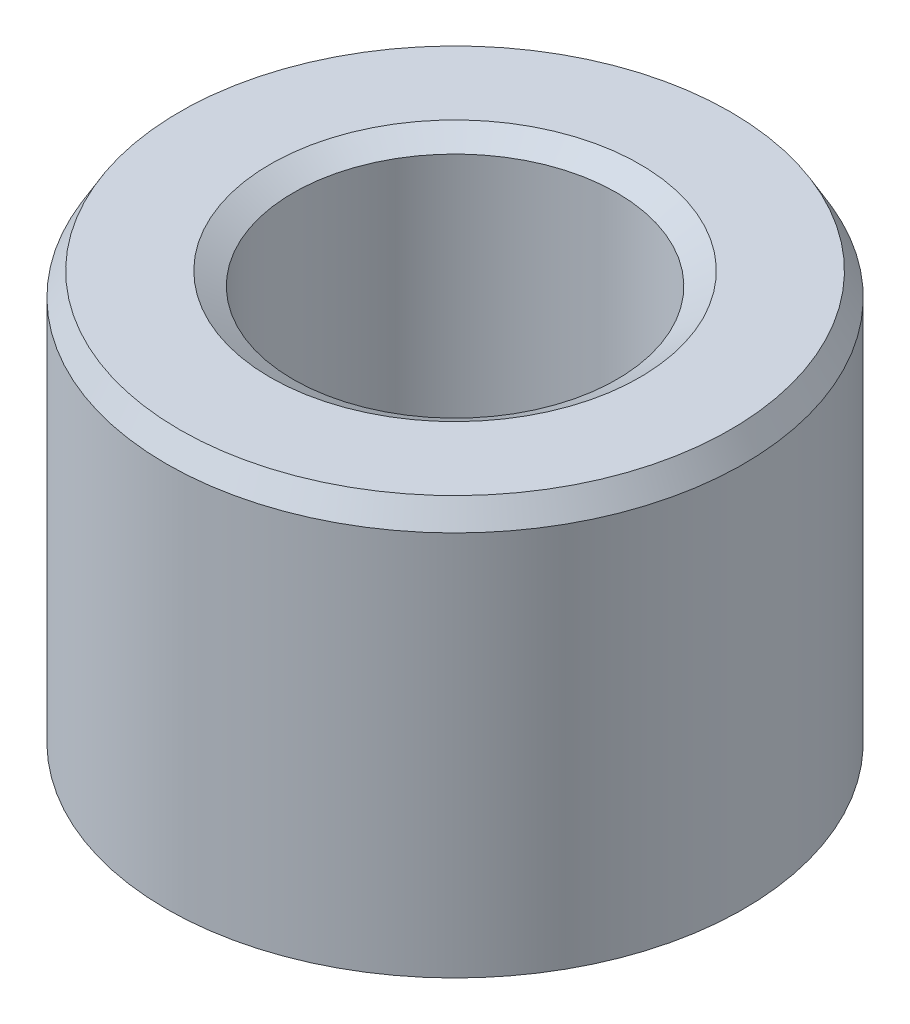
ISO-10303-21;
HEADER;
FILE_DESCRIPTION(('STEP AP214'),'2;1');
FILE_NAME('part.step','',(''),(''),'','','');
FILE_SCHEMA(('AUTOMOTIVE_DESIGN { 1 0 10303 214 1 1 1 1 }'));
ENDSEC;
DATA;
#1=APPLICATION_CONTEXT('core data for automotive mechanical design processes');
#2=APPLICATION_PROTOCOL_DEFINITION('international standard','automotive_design',2000,#1);
#3=PRODUCT_CONTEXT('',#1,'mechanical');
#4=PRODUCT('Part','Part','',(#3));
#5=PRODUCT_RELATED_PRODUCT_CATEGORY('part','',(#4));
#6=PRODUCT_DEFINITION_FORMATION('','',#4);
#7=PRODUCT_DEFINITION_CONTEXT('part definition',#1,'design');
#8=PRODUCT_DEFINITION('design','',#6,#7);
#9=PRODUCT_DEFINITION_SHAPE('','',#8);
#10=(LENGTH_UNIT() NAMED_UNIT(*) SI_UNIT(.MILLI.,.METRE.));
#11=(NAMED_UNIT(*) PLANE_ANGLE_UNIT() SI_UNIT($,.RADIAN.));
#12=(NAMED_UNIT(*) SI_UNIT($,.STERADIAN.) SOLID_ANGLE_UNIT());
#13=UNCERTAINTY_MEASURE_WITH_UNIT(LENGTH_MEASURE(1.E-05),#10,'distance_accuracy_value','');
#14=(GEOMETRIC_REPRESENTATION_CONTEXT(3) GLOBAL_UNCERTAINTY_ASSIGNED_CONTEXT((#13)) GLOBAL_UNIT_ASSIGNED_CONTEXT((#10,
#11,#12)) REPRESENTATION_CONTEXT('',''));
#15=CARTESIAN_POINT('',(0.,0.,0.));
#16=DIRECTION('',(0.,0.,1.));
#17=DIRECTION('',(1.,0.,0.));
#18=AXIS2_PLACEMENT_3D('',#15,#16,#17);
#19=CARTESIAN_POINT('',(0.,32.8723258040792,0.));
#20=DIRECTION('',(0.,-1.,0.));
#21=DIRECTION('',(0.,0.,-1.));
#22=AXIS2_PLACEMENT_3D('',#19,#20,#21);
#23=CYLINDRICAL_SURFACE('',#22,22.5);
#24=CARTESIAN_POINT('',(0.,1.03474750915446,0.));
#25=DIRECTION('',(0.,1.,0.));
#26=DIRECTION('',(0.,0.,1.));
#27=AXIS2_PLACEMENT_3D('',#24,#25,#26);
#28=CIRCLE('',#27,22.5);
#29=CARTESIAN_POINT('',(0.,1.03474750915446,22.5));
#30=VERTEX_POINT('',#29);
#31=EDGE_CURVE('E10',#30,#30,#28,.T.);
#32=ORIENTED_EDGE('',*,*,#31,.T.);
#33=EDGE_LOOP('',(#32));
#34=FACE_BOUND('',#33,.T.);
#35=CARTESIAN_POINT('',(0.,31.0800905452183,0.));
#36=DIRECTION('',(0.,1.,0.));
#37=DIRECTION('',(0.,0.,1.));
#38=AXIS2_PLACEMENT_3D('',#35,#36,#37);
#39=CIRCLE('',#38,22.5);
#40=CARTESIAN_POINT('',(0.,31.0800905452183,22.5));
#41=VERTEX_POINT('',#40);
#42=EDGE_CURVE('E50',#41,#41,#39,.F.);
#43=ORIENTED_EDGE('',*,*,#42,.T.);
#44=EDGE_LOOP('',(#43));
#45=FACE_BOUND('',#44,.T.);
#46=ADVANCED_FACE('F39',(#34,#45),#23,.T.);
#47=CARTESIAN_POINT('',(0.,32.8723258040792,0.));
#48=DIRECTION('',(0.,1.,0.));
#49=DIRECTION('',(0.,0.,1.));
#50=AXIS2_PLACEMENT_3D('',#47,#48,#49);
#51=PLANE('',#50);
#52=CARTESIAN_POINT('',(0.,32.8723258040792,0.));
#53=DIRECTION('',(0.,1.,0.));
#54=DIRECTION('',(0.,0.,1.));
#55=AXIS2_PLACEMENT_3D('',#52,#53,#54);
#56=CIRCLE('',#55,14.4034467598533);
#57=CARTESIAN_POINT('',(0.,32.8723258040792,14.4034467598533));
#58=VERTEX_POINT('',#57);
#59=EDGE_CURVE('E58',#58,#58,#56,.F.);
#60=ORIENTED_EDGE('',*,*,#59,.T.);
#61=EDGE_LOOP('',(#60));
#62=FACE_BOUND('',#61,.T.);
#63=CARTESIAN_POINT('',(0.,32.8723258040792,0.));
#64=DIRECTION('',(0.,1.,0.));
#65=DIRECTION('',(0.,0.,1.));
#66=AXIS2_PLACEMENT_3D('',#63,#64,#65);
#67=CIRCLE('',#66,21.4652524908455);
#68=CARTESIAN_POINT('',(0.,32.8723258040792,21.4652524908455));
#69=VERTEX_POINT('',#68);
#70=EDGE_CURVE('E61',#69,#69,#67,.T.);
#71=ORIENTED_EDGE('',*,*,#70,.T.);
#72=EDGE_LOOP('',(#71));
#73=FACE_BOUND('',#72,.T.);
#74=ADVANCED_FACE('F88',(#62,#73),#51,.T.);
#75=CARTESIAN_POINT('',(0.,0.,0.));
#76=DIRECTION('',(0.,1.,0.));
#77=DIRECTION('',(0.,0.,1.));
#78=AXIS2_PLACEMENT_3D('',#75,#76,#77);
#79=PLANE('',#78);
#80=CARTESIAN_POINT('',(0.,0.,0.));
#81=DIRECTION('',(0.,1.,0.));
#82=DIRECTION('',(0.,0.,1.));
#83=AXIS2_PLACEMENT_3D('',#80,#81,#82);
#84=CIRCLE('',#83,13.6459590101469);
#85=CARTESIAN_POINT('',(0.,0.,13.6459590101469));
#86=VERTEX_POINT('',#85);
#87=EDGE_CURVE('E51',#86,#86,#84,.T.);
#88=ORIENTED_EDGE('',*,*,#87,.T.);
#89=EDGE_LOOP('',(#88));
#90=FACE_BOUND('',#89,.T.);
#91=CARTESIAN_POINT('',(0.,0.,0.));
#92=DIRECTION('',(0.,1.,0.));
#93=DIRECTION('',(0.,0.,1.));
#94=AXIS2_PLACEMENT_3D('',#91,#92,#93);
#95=CIRCLE('',#94,20.7077647411391);
#96=CARTESIAN_POINT('',(0.,0.,20.7077647411391));
#97=VERTEX_POINT('',#96);
#98=EDGE_CURVE('E54',#97,#97,#95,.F.);
#99=ORIENTED_EDGE('',*,*,#98,.T.);
#100=EDGE_LOOP('',(#99));
#101=FACE_BOUND('',#100,.T.);
#102=ADVANCED_FACE('F83',(#90,#101),#79,.F.);
#103=CARTESIAN_POINT('',(0.,32.8723258040792,0.));
#104=DIRECTION('',(0.,-1.,0.));
#105=DIRECTION('',(0.,0.,-1.));
#106=AXIS2_PLACEMENT_3D('',#103,#104,#105);
#107=CYLINDRICAL_SURFACE('',#106,12.6112115009925);
#108=CARTESIAN_POINT('',(0.,31.8375782949247,0.));
#109=DIRECTION('',(0.,1.,0.));
#110=DIRECTION('',(0.,0.,1.));
#111=AXIS2_PLACEMENT_3D('',#108,#109,#110);
#112=CIRCLE('',#111,12.6112115009925);
#113=CARTESIAN_POINT('',(0.,31.8375782949247,12.6112115009925));
#114=VERTEX_POINT('',#113);
#115=EDGE_CURVE('E67',#114,#114,#112,.T.);
#116=ORIENTED_EDGE('',*,*,#115,.T.);
#117=EDGE_LOOP('',(#116));
#118=FACE_BOUND('',#117,.T.);
#119=CARTESIAN_POINT('',(0.,1.7922352588609,0.));
#120=DIRECTION('',(0.,1.,0.));
#121=DIRECTION('',(0.,0.,1.));
#122=AXIS2_PLACEMENT_3D('',#119,#120,#121);
#123=CIRCLE('',#122,12.6112115009925);
#124=CARTESIAN_POINT('',(0.,1.7922352588609,12.6112115009925));
#125=VERTEX_POINT('',#124);
#126=EDGE_CURVE('E69',#125,#125,#123,.F.);
#127=ORIENTED_EDGE('',*,*,#126,.T.);
#128=EDGE_LOOP('',(#127));
#129=FACE_BOUND('',#128,.T.);
#130=ADVANCED_FACE('F71',(#118,#129),#107,.F.);
#131=CARTESIAN_POINT('',(0.,31.8375782949247,0.));
#132=DIRECTION('',(0.,1.,0.));
#133=DIRECTION('',(0.,0.,1.));
#134=AXIS2_PLACEMENT_3D('',#131,#132,#133);
#135=CONICAL_SURFACE('',#134,12.6112115009925,1.0471975511966);
#136=ORIENTED_EDGE('',*,*,#59,.F.);
#137=EDGE_LOOP('',(#136));
#138=FACE_BOUND('',#137,.T.);
#139=ORIENTED_EDGE('',*,*,#115,.F.);
#140=EDGE_LOOP('',(#139));
#141=FACE_BOUND('',#140,.T.);
#142=ADVANCED_FACE('F77',(#138,#141),#135,.F.);
#143=CARTESIAN_POINT('',(0.,0.,0.));
#144=DIRECTION('',(0.,-1.,0.));
#145=DIRECTION('',(0.,0.,-1.));
#146=AXIS2_PLACEMENT_3D('',#143,#144,#145);
#147=CONICAL_SURFACE('',#146,13.6459590101469,0.523598775598294);
#148=ORIENTED_EDGE('',*,*,#126,.F.);
#149=EDGE_LOOP('',(#148));
#150=FACE_BOUND('',#149,.T.);
#151=ORIENTED_EDGE('',*,*,#87,.F.);
#152=EDGE_LOOP('',(#151));
#153=FACE_BOUND('',#152,.T.);
#154=ADVANCED_FACE('F73',(#150,#153),#147,.F.);
#155=CARTESIAN_POINT('',(0.,1.03474750915446,0.));
#156=DIRECTION('',(0.,1.,0.));
#157=DIRECTION('',(0.,0.,1.));
#158=AXIS2_PLACEMENT_3D('',#155,#156,#157);
#159=CONICAL_SURFACE('',#158,22.5,1.0471975511966);
#160=ORIENTED_EDGE('',*,*,#98,.F.);
#161=EDGE_LOOP('',(#160));
#162=FACE_BOUND('',#161,.T.);
#163=ORIENTED_EDGE('',*,*,#31,.F.);
#164=EDGE_LOOP('',(#163));
#165=FACE_BOUND('',#164,.T.);
#166=ADVANCED_FACE('F76',(#162,#165),#159,.T.);
#167=CARTESIAN_POINT('',(0.,32.8723258040792,0.));
#168=DIRECTION('',(0.,-1.,0.));
#169=DIRECTION('',(0.,0.,-1.));
#170=AXIS2_PLACEMENT_3D('',#167,#168,#169);
#171=CONICAL_SURFACE('',#170,21.4652524908455,0.523598775598296);
#172=ORIENTED_EDGE('',*,*,#42,.F.);
#173=EDGE_LOOP('',(#172));
#174=FACE_BOUND('',#173,.T.);
#175=ORIENTED_EDGE('',*,*,#70,.F.);
#176=EDGE_LOOP('',(#175));
#177=FACE_BOUND('',#176,.T.);
#178=ADVANCED_FACE('F45',(#174,#177),#171,.T.);
#179=CLOSED_SHELL('',(#46,#74,#102,#130,#142,#154,#166,#178));
#180=MANIFOLD_SOLID_BREP('B2',#179);
#181=ADVANCED_BREP_SHAPE_REPRESENTATION('',(#18,#180),#14);
#182=SHAPE_DEFINITION_REPRESENTATION(#9,#181);
ENDSEC;
END-ISO-10303-21;
